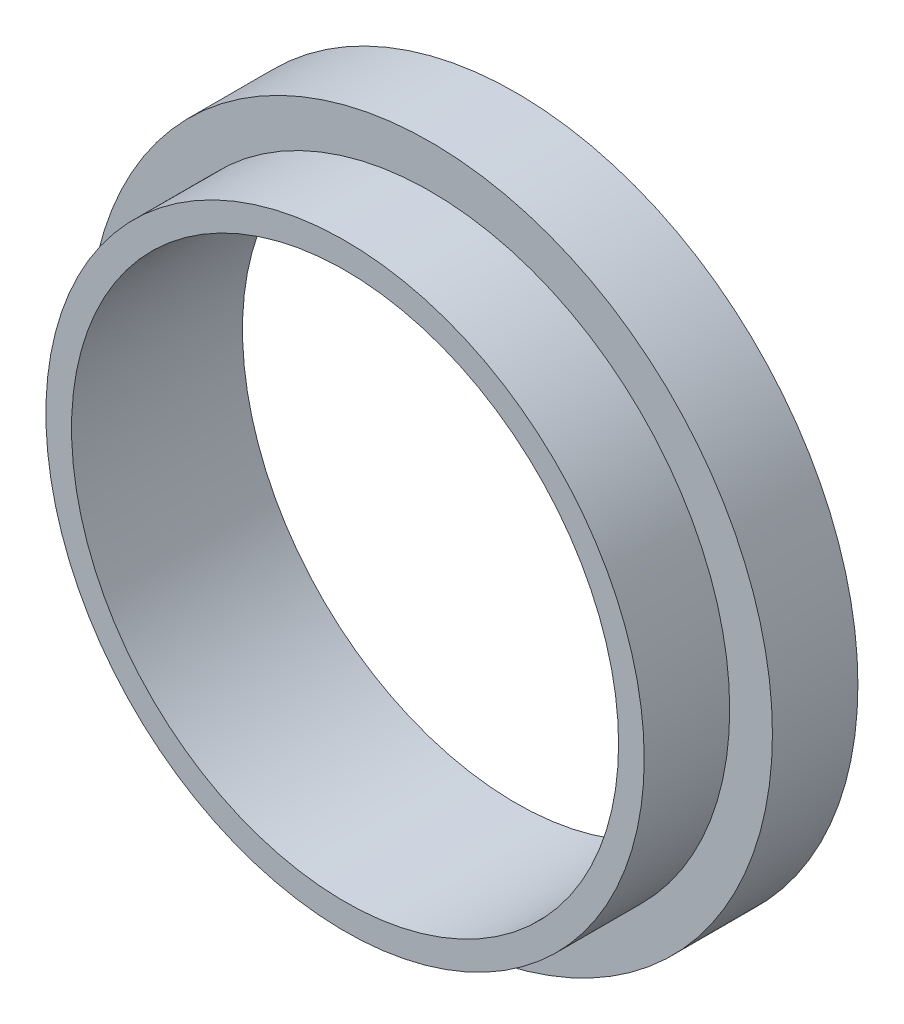
ISO-10303-21;
HEADER;
FILE_DESCRIPTION(('STEP AP214'),'2;1');
FILE_NAME('part.step','',(''),(''),'','','');
FILE_SCHEMA(('AUTOMOTIVE_DESIGN { 1 0 10303 214 1 1 1 1 }'));
ENDSEC;
DATA;
#1=APPLICATION_CONTEXT('core data for automotive mechanical design processes');
#2=APPLICATION_PROTOCOL_DEFINITION('international standard','automotive_design',2000,#1);
#3=PRODUCT_CONTEXT('',#1,'mechanical');
#4=PRODUCT('Part','Part','',(#3));
#5=PRODUCT_RELATED_PRODUCT_CATEGORY('part','',(#4));
#6=PRODUCT_DEFINITION_FORMATION('','',#4);
#7=PRODUCT_DEFINITION_CONTEXT('part definition',#1,'design');
#8=PRODUCT_DEFINITION('design','',#6,#7);
#9=PRODUCT_DEFINITION_SHAPE('','',#8);
#10=(LENGTH_UNIT() NAMED_UNIT(*) SI_UNIT(.MILLI.,.METRE.));
#11=(NAMED_UNIT(*) PLANE_ANGLE_UNIT() SI_UNIT($,.RADIAN.));
#12=(NAMED_UNIT(*) SI_UNIT($,.STERADIAN.) SOLID_ANGLE_UNIT());
#13=UNCERTAINTY_MEASURE_WITH_UNIT(LENGTH_MEASURE(1.E-05),#10,'distance_accuracy_value','');
#14=(GEOMETRIC_REPRESENTATION_CONTEXT(3) GLOBAL_UNCERTAINTY_ASSIGNED_CONTEXT((#13)) GLOBAL_UNIT_ASSIGNED_CONTEXT((#10,
#11,#12)) REPRESENTATION_CONTEXT('',''));
#15=CARTESIAN_POINT('',(0.,0.,0.));
#16=DIRECTION('',(0.,0.,1.));
#17=DIRECTION('',(1.,0.,0.));
#18=AXIS2_PLACEMENT_3D('',#15,#16,#17);
#19=CARTESIAN_POINT('',(0.,0.,10.));
#20=DIRECTION('',(0.,0.,1.));
#21=DIRECTION('',(1.,0.,0.));
#22=AXIS2_PLACEMENT_3D('',#19,#20,#21);
#23=PLANE('',#22);
#24=CARTESIAN_POINT('',(0.,0.,10.));
#25=DIRECTION('',(0.,0.,1.));
#26=DIRECTION('',(1.,0.,0.));
#27=AXIS2_PLACEMENT_3D('',#24,#25,#26);
#28=CIRCLE('',#27,35.);
#29=CARTESIAN_POINT('',(35.,0.,10.));
#30=VERTEX_POINT('',#29);
#31=EDGE_CURVE('E10',#30,#30,#28,.T.);
#32=ORIENTED_EDGE('',*,*,#31,.T.);
#33=EDGE_LOOP('',(#32));
#34=FACE_BOUND('',#33,.T.);
#35=CARTESIAN_POINT('',(0.,0.,10.));
#36=DIRECTION('',(0.,0.,1.));
#37=DIRECTION('',(1.,0.,0.));
#38=AXIS2_PLACEMENT_3D('',#35,#36,#37);
#39=CIRCLE('',#38,32.);
#40=CARTESIAN_POINT('',(32.,0.,10.));
#41=VERTEX_POINT('',#40);
#42=EDGE_CURVE('E38',#41,#41,#39,.T.);
#43=ORIENTED_EDGE('',*,*,#42,.F.);
#44=EDGE_LOOP('',(#43));
#45=FACE_BOUND('',#44,.T.);
#46=ADVANCED_FACE('F31',(#34,#45),#23,.T.);
#47=CARTESIAN_POINT('',(0.,0.,10.));
#48=DIRECTION('',(0.,0.,-1.));
#49=DIRECTION('',(-1.,0.,0.));
#50=AXIS2_PLACEMENT_3D('',#47,#48,#49);
#51=CYLINDRICAL_SURFACE('',#50,35.);
#52=ORIENTED_EDGE('',*,*,#31,.F.);
#53=EDGE_LOOP('',(#52));
#54=FACE_BOUND('',#53,.T.);
#55=CARTESIAN_POINT('',(0.,0.,0.));
#56=DIRECTION('',(0.,0.,1.));
#57=DIRECTION('',(1.,0.,0.));
#58=AXIS2_PLACEMENT_3D('',#55,#56,#57);
#59=CIRCLE('',#58,35.);
#60=CARTESIAN_POINT('',(35.,0.,0.));
#61=VERTEX_POINT('',#60);
#62=EDGE_CURVE('E42',#61,#61,#59,.T.);
#63=ORIENTED_EDGE('',*,*,#62,.T.);
#64=EDGE_LOOP('',(#63));
#65=FACE_BOUND('',#64,.T.);
#66=ADVANCED_FACE('F33',(#54,#65),#51,.T.);
#67=CARTESIAN_POINT('',(0.,0.,10.));
#68=DIRECTION('',(0.,0.,-1.));
#69=DIRECTION('',(-1.,0.,0.));
#70=AXIS2_PLACEMENT_3D('',#67,#68,#69);
#71=CYLINDRICAL_SURFACE('',#70,32.);
#72=ORIENTED_EDGE('',*,*,#42,.T.);
#73=EDGE_LOOP('',(#72));
#74=FACE_BOUND('',#73,.T.);
#75=CARTESIAN_POINT('',(0.,0.,-10.));
#76=DIRECTION('',(0.,0.,1.));
#77=DIRECTION('',(1.,0.,0.));
#78=AXIS2_PLACEMENT_3D('',#75,#76,#77);
#79=CIRCLE('',#78,32.);
#80=CARTESIAN_POINT('',(32.,0.,-10.));
#81=VERTEX_POINT('',#80);
#82=EDGE_CURVE('E52',#81,#81,#79,.T.);
#83=ORIENTED_EDGE('',*,*,#82,.F.);
#84=EDGE_LOOP('',(#83));
#85=FACE_BOUND('',#84,.T.);
#86=ADVANCED_FACE('F61',(#74,#85),#71,.F.);
#87=CARTESIAN_POINT('',(0.,0.,0.));
#88=DIRECTION('',(0.,0.,1.));
#89=DIRECTION('',(1.,0.,0.));
#90=AXIS2_PLACEMENT_3D('',#87,#88,#89);
#91=PLANE('',#90);
#92=CARTESIAN_POINT('',(0.,0.,0.));
#93=DIRECTION('',(0.,0.,1.));
#94=DIRECTION('',(1.,0.,0.));
#95=AXIS2_PLACEMENT_3D('',#92,#93,#94);
#96=CIRCLE('',#95,40.);
#97=CARTESIAN_POINT('',(40.,0.,0.));
#98=VERTEX_POINT('',#97);
#99=EDGE_CURVE('E49',#98,#98,#96,.T.);
#100=ORIENTED_EDGE('',*,*,#99,.T.);
#101=EDGE_LOOP('',(#100));
#102=FACE_BOUND('',#101,.T.);
#103=ORIENTED_EDGE('',*,*,#62,.F.);
#104=EDGE_LOOP('',(#103));
#105=FACE_BOUND('',#104,.T.);
#106=ADVANCED_FACE('F63',(#102,#105),#91,.T.);
#107=CARTESIAN_POINT('',(0.,0.,-10.));
#108=DIRECTION('',(0.,0.,1.));
#109=DIRECTION('',(1.,0.,0.));
#110=AXIS2_PLACEMENT_3D('',#107,#108,#109);
#111=CYLINDRICAL_SURFACE('',#110,40.);
#112=CARTESIAN_POINT('',(0.,0.,-10.));
#113=DIRECTION('',(0.,0.,1.));
#114=DIRECTION('',(1.,0.,0.));
#115=AXIS2_PLACEMENT_3D('',#112,#113,#114);
#116=CIRCLE('',#115,40.);
#117=CARTESIAN_POINT('',(40.,0.,-10.));
#118=VERTEX_POINT('',#117);
#119=EDGE_CURVE('E46',#118,#118,#116,.T.);
#120=ORIENTED_EDGE('',*,*,#119,.T.);
#121=EDGE_LOOP('',(#120));
#122=FACE_BOUND('',#121,.T.);
#123=ORIENTED_EDGE('',*,*,#99,.F.);
#124=EDGE_LOOP('',(#123));
#125=FACE_BOUND('',#124,.T.);
#126=ADVANCED_FACE('F69',(#122,#125),#111,.T.);
#127=CARTESIAN_POINT('',(0.,0.,-10.));
#128=DIRECTION('',(0.,0.,1.));
#129=DIRECTION('',(1.,0.,0.));
#130=AXIS2_PLACEMENT_3D('',#127,#128,#129);
#131=PLANE('',#130);
#132=ORIENTED_EDGE('',*,*,#82,.T.);
#133=EDGE_LOOP('',(#132));
#134=FACE_BOUND('',#133,.T.);
#135=ORIENTED_EDGE('',*,*,#119,.F.);
#136=EDGE_LOOP('',(#135));
#137=FACE_BOUND('',#136,.T.);
#138=ADVANCED_FACE('F58',(#134,#137),#131,.F.);
#139=CLOSED_SHELL('',(#46,#66,#86,#106,#126,#138));
#140=MANIFOLD_SOLID_BREP('B2',#139);
#141=ADVANCED_BREP_SHAPE_REPRESENTATION('',(#18,#140),#14);
#142=SHAPE_DEFINITION_REPRESENTATION(#9,#141);
ENDSEC;
END-ISO-10303-21;
